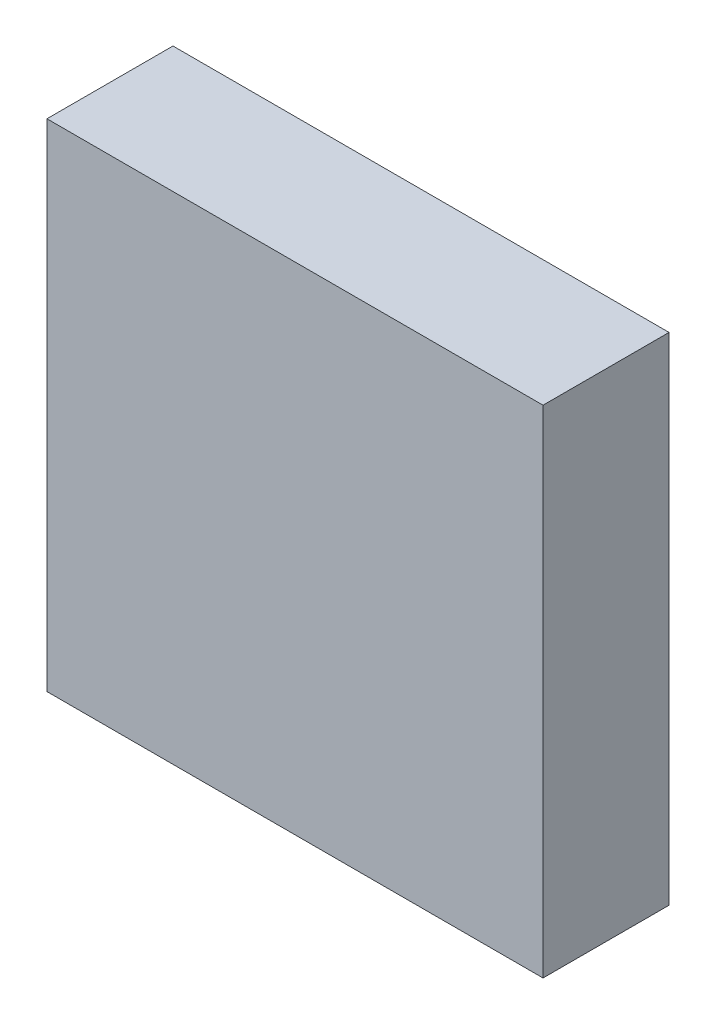
ISO-10303-21;
HEADER;
FILE_DESCRIPTION(('STEP AP214'),'2;1');
FILE_NAME('part.step','',(''),(''),'','','');
FILE_SCHEMA(('AUTOMOTIVE_DESIGN { 1 0 10303 214 1 1 1 1 }'));
ENDSEC;
DATA;
#1=APPLICATION_CONTEXT('core data for automotive mechanical design processes');
#2=APPLICATION_PROTOCOL_DEFINITION('international standard','automotive_design',2000,#1);
#3=PRODUCT_CONTEXT('',#1,'mechanical');
#4=PRODUCT('Part','Part','',(#3));
#5=PRODUCT_RELATED_PRODUCT_CATEGORY('part','',(#4));
#6=PRODUCT_DEFINITION_FORMATION('','',#4);
#7=PRODUCT_DEFINITION_CONTEXT('part definition',#1,'design');
#8=PRODUCT_DEFINITION('design','',#6,#7);
#9=PRODUCT_DEFINITION_SHAPE('','',#8);
#10=(LENGTH_UNIT() NAMED_UNIT(*) SI_UNIT(.MILLI.,.METRE.));
#11=(NAMED_UNIT(*) PLANE_ANGLE_UNIT() SI_UNIT($,.RADIAN.));
#12=(NAMED_UNIT(*) SI_UNIT($,.STERADIAN.) SOLID_ANGLE_UNIT());
#13=UNCERTAINTY_MEASURE_WITH_UNIT(LENGTH_MEASURE(1.E-05),#10,'distance_accuracy_value','');
#14=(GEOMETRIC_REPRESENTATION_CONTEXT(3) GLOBAL_UNCERTAINTY_ASSIGNED_CONTEXT((#13)) GLOBAL_UNIT_ASSIGNED_CONTEXT((#10,
#11,#12)) REPRESENTATION_CONTEXT('',''));
#15=CARTESIAN_POINT('',(0.,0.,0.));
#16=DIRECTION('',(0.,0.,1.));
#17=DIRECTION('',(1.,0.,0.));
#18=AXIS2_PLACEMENT_3D('',#15,#16,#17);
#19=CARTESIAN_POINT('',(-1.549,-1.549,0.051));
#20=DIRECTION('',(0.,-1.,0.));
#21=DIRECTION('',(0.,0.,-1.));
#22=AXIS2_PLACEMENT_3D('',#19,#20,#21);
#23=PLANE('',#22);
#24=DIRECTION('',(-1.,0.,0.));
#25=VECTOR('',#24,1.);
#26=CARTESIAN_POINT('',(1.549,-1.549,0.051));
#27=LINE('',#26,#25);
#28=CARTESIAN_POINT('',(1.549,-1.549,0.051));
#29=VERTEX_POINT('',#28);
#30=CARTESIAN_POINT('',(-1.549,-1.549,0.051));
#31=VERTEX_POINT('',#30);
#32=EDGE_CURVE('E11',#29,#31,#27,.T.);
#33=ORIENTED_EDGE('',*,*,#32,.F.);
#34=DIRECTION('',(0.,0.,-1.));
#35=VECTOR('',#34,1.);
#36=CARTESIAN_POINT('',(1.549,-1.549,0.838));
#37=LINE('',#36,#35);
#38=CARTESIAN_POINT('',(1.549,-1.549,0.838));
#39=VERTEX_POINT('',#38);
#40=EDGE_CURVE('E24',#39,#29,#37,.T.);
#41=ORIENTED_EDGE('',*,*,#40,.F.);
#42=DIRECTION('',(1.,0.,0.));
#43=VECTOR('',#42,1.);
#44=CARTESIAN_POINT('',(-1.549,-1.549,0.838));
#45=LINE('',#44,#43);
#46=CARTESIAN_POINT('',(-1.549,-1.549,0.838));
#47=VERTEX_POINT('',#46);
#48=EDGE_CURVE('E88',#47,#39,#45,.T.);
#49=ORIENTED_EDGE('',*,*,#48,.F.);
#50=DIRECTION('',(0.,0.,1.));
#51=VECTOR('',#50,1.);
#52=CARTESIAN_POINT('',(-1.549,-1.549,0.051));
#53=LINE('',#52,#51);
#54=EDGE_CURVE('E77',#31,#47,#53,.T.);
#55=ORIENTED_EDGE('',*,*,#54,.F.);
#56=EDGE_LOOP('',(#33,#41,#49,#55));
#57=FACE_BOUND('',#56,.T.);
#58=ADVANCED_FACE('F17',(#57),#23,.T.);
#59=CARTESIAN_POINT('',(1.549,-1.549,0.051));
#60=DIRECTION('',(1.,0.,0.));
#61=DIRECTION('',(0.,1.,0.));
#62=AXIS2_PLACEMENT_3D('',#59,#60,#61);
#63=PLANE('',#62);
#64=DIRECTION('',(0.,-1.,0.));
#65=VECTOR('',#64,1.);
#66=CARTESIAN_POINT('',(1.549,1.549,0.051));
#67=LINE('',#66,#65);
#68=CARTESIAN_POINT('',(1.549,1.549,0.051));
#69=VERTEX_POINT('',#68);
#70=EDGE_CURVE('E85',#69,#29,#67,.T.);
#71=ORIENTED_EDGE('',*,*,#70,.F.);
#72=DIRECTION('',(0.,0.,-1.));
#73=VECTOR('',#72,1.);
#74=CARTESIAN_POINT('',(1.549,1.549,0.838));
#75=LINE('',#74,#73);
#76=CARTESIAN_POINT('',(1.549,1.549,0.838));
#77=VERTEX_POINT('',#76);
#78=EDGE_CURVE('E83',#77,#69,#75,.T.);
#79=ORIENTED_EDGE('',*,*,#78,.F.);
#80=DIRECTION('',(0.,1.,0.));
#81=VECTOR('',#80,1.);
#82=CARTESIAN_POINT('',(1.549,-1.549,0.838));
#83=LINE('',#82,#81);
#84=EDGE_CURVE('E72',#39,#77,#83,.T.);
#85=ORIENTED_EDGE('',*,*,#84,.F.);
#86=ORIENTED_EDGE('',*,*,#40,.T.);
#87=EDGE_LOOP('',(#71,#79,#85,#86));
#88=FACE_BOUND('',#87,.T.);
#89=ADVANCED_FACE('F90',(#88),#63,.T.);
#90=CARTESIAN_POINT('',(1.549,1.549,0.051));
#91=DIRECTION('',(0.,1.,0.));
#92=DIRECTION('',(1.,0.,0.));
#93=AXIS2_PLACEMENT_3D('',#90,#91,#92);
#94=PLANE('',#93);
#95=DIRECTION('',(1.,0.,0.));
#96=VECTOR('',#95,1.);
#97=CARTESIAN_POINT('',(-1.549,1.549,0.051));
#98=LINE('',#97,#96);
#99=CARTESIAN_POINT('',(-1.549,1.549,0.051));
#100=VERTEX_POINT('',#99);
#101=EDGE_CURVE('E60',#100,#69,#98,.T.);
#102=ORIENTED_EDGE('',*,*,#101,.F.);
#103=DIRECTION('',(0.,0.,-1.));
#104=VECTOR('',#103,1.);
#105=CARTESIAN_POINT('',(-1.549,1.549,0.838));
#106=LINE('',#105,#104);
#107=CARTESIAN_POINT('',(-1.549,1.549,0.838));
#108=VERTEX_POINT('',#107);
#109=EDGE_CURVE('E54',#108,#100,#106,.T.);
#110=ORIENTED_EDGE('',*,*,#109,.F.);
#111=DIRECTION('',(-1.,0.,0.));
#112=VECTOR('',#111,1.);
#113=CARTESIAN_POINT('',(1.549,1.549,0.838));
#114=LINE('',#113,#112);
#115=EDGE_CURVE('E58',#77,#108,#114,.T.);
#116=ORIENTED_EDGE('',*,*,#115,.F.);
#117=ORIENTED_EDGE('',*,*,#78,.T.);
#118=EDGE_LOOP('',(#102,#110,#116,#117));
#119=FACE_BOUND('',#118,.T.);
#120=ADVANCED_FACE('F56',(#119),#94,.T.);
#121=CARTESIAN_POINT('',(-1.549,1.549,0.051));
#122=DIRECTION('',(-1.,0.,0.));
#123=DIRECTION('',(0.,0.,1.));
#124=AXIS2_PLACEMENT_3D('',#121,#122,#123);
#125=PLANE('',#124);
#126=DIRECTION('',(0.,1.,0.));
#127=VECTOR('',#126,1.);
#128=CARTESIAN_POINT('',(-1.549,-1.549,0.051));
#129=LINE('',#128,#127);
#130=EDGE_CURVE('E73',#31,#100,#129,.T.);
#131=ORIENTED_EDGE('',*,*,#130,.F.);
#132=ORIENTED_EDGE('',*,*,#54,.T.);
#133=DIRECTION('',(0.,-1.,0.));
#134=VECTOR('',#133,1.);
#135=CARTESIAN_POINT('',(-1.549,1.549,0.838));
#136=LINE('',#135,#134);
#137=EDGE_CURVE('E70',#108,#47,#136,.T.);
#138=ORIENTED_EDGE('',*,*,#137,.F.);
#139=ORIENTED_EDGE('',*,*,#109,.T.);
#140=EDGE_LOOP('',(#131,#132,#138,#139));
#141=FACE_BOUND('',#140,.T.);
#142=ADVANCED_FACE('F76',(#141),#125,.T.);
#143=CARTESIAN_POINT('',(-1.549,1.549,0.051));
#144=DIRECTION('',(0.,0.,-1.));
#145=DIRECTION('',(0.,-1.,0.));
#146=AXIS2_PLACEMENT_3D('',#143,#144,#145);
#147=PLANE('',#146);
#148=ORIENTED_EDGE('',*,*,#101,.T.);
#149=ORIENTED_EDGE('',*,*,#70,.T.);
#150=ORIENTED_EDGE('',*,*,#32,.T.);
#151=ORIENTED_EDGE('',*,*,#130,.T.);
#152=EDGE_LOOP('',(#148,#149,#150,#151));
#153=FACE_BOUND('',#152,.T.);
#154=ADVANCED_FACE('F91',(#153),#147,.T.);
#155=CARTESIAN_POINT('',(-1.549,-1.549,0.838));
#156=DIRECTION('',(0.,0.,1.));
#157=DIRECTION('',(1.,0.,0.));
#158=AXIS2_PLACEMENT_3D('',#155,#156,#157);
#159=PLANE('',#158);
#160=ORIENTED_EDGE('',*,*,#48,.T.);
#161=ORIENTED_EDGE('',*,*,#84,.T.);
#162=ORIENTED_EDGE('',*,*,#115,.T.);
#163=ORIENTED_EDGE('',*,*,#137,.T.);
#164=EDGE_LOOP('',(#160,#161,#162,#163));
#165=FACE_BOUND('',#164,.T.);
#166=ADVANCED_FACE('F69',(#165),#159,.T.);
#167=CLOSED_SHELL('',(#58,#89,#120,#142,#154,#166));
#168=MANIFOLD_SOLID_BREP('B1',#167);
#169=ADVANCED_BREP_SHAPE_REPRESENTATION('',(#18,#168),#14);
#170=SHAPE_DEFINITION_REPRESENTATION(#9,#169);
ENDSEC;
END-ISO-10303-21;
